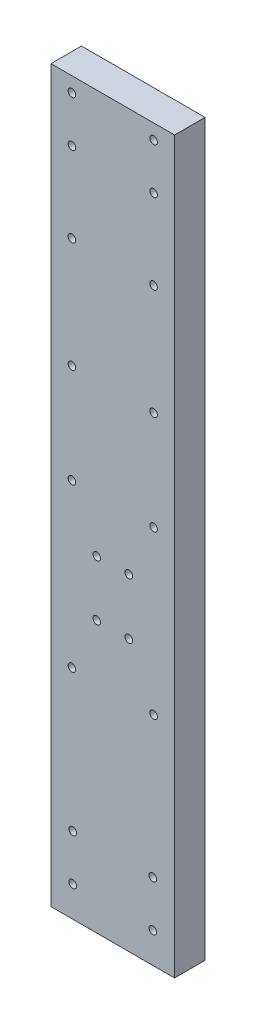
ISO-10303-21;
HEADER;
FILE_DESCRIPTION(('STEP AP214'),'2;1');
FILE_NAME('part.step','',(''),(''),'','','');
FILE_SCHEMA(('AUTOMOTIVE_DESIGN { 1 0 10303 214 1 1 1 1 }'));
ENDSEC;
DATA;
#1=APPLICATION_CONTEXT('core data for automotive mechanical design processes');
#2=APPLICATION_PROTOCOL_DEFINITION('international standard','automotive_design',2000,#1);
#3=PRODUCT_CONTEXT('',#1,'mechanical');
#4=PRODUCT('Part','Part','',(#3));
#5=PRODUCT_RELATED_PRODUCT_CATEGORY('part','',(#4));
#6=PRODUCT_DEFINITION_FORMATION('','',#4);
#7=PRODUCT_DEFINITION_CONTEXT('part definition',#1,'design');
#8=PRODUCT_DEFINITION('design','',#6,#7);
#9=PRODUCT_DEFINITION_SHAPE('','',#8);
#10=(LENGTH_UNIT() NAMED_UNIT(*) SI_UNIT(.MILLI.,.METRE.));
#11=(NAMED_UNIT(*) PLANE_ANGLE_UNIT() SI_UNIT($,.RADIAN.));
#12=(NAMED_UNIT(*) SI_UNIT($,.STERADIAN.) SOLID_ANGLE_UNIT());
#13=UNCERTAINTY_MEASURE_WITH_UNIT(LENGTH_MEASURE(1.E-05),#10,'distance_accuracy_value','');
#14=(GEOMETRIC_REPRESENTATION_CONTEXT(3) GLOBAL_UNCERTAINTY_ASSIGNED_CONTEXT((#13)) GLOBAL_UNIT_ASSIGNED_CONTEXT((#10,
#11,#12)) REPRESENTATION_CONTEXT('',''));
#15=CARTESIAN_POINT('',(0.,0.,0.));
#16=DIRECTION('',(0.,0.,1.));
#17=DIRECTION('',(1.,0.,0.));
#18=AXIS2_PLACEMENT_3D('',#15,#16,#17);
#19=CARTESIAN_POINT('',(0.,0.,4.));
#20=DIRECTION('',(0.,0.,-1.));
#21=DIRECTION('',(-1.,0.,0.));
#22=AXIS2_PLACEMENT_3D('',#19,#20,#21);
#23=PLANE('',#22);
#24=CARTESIAN_POINT('',(2.7500000000009,93.5614488310554,4.));
#25=DIRECTION('',(0.,0.,1.));
#26=DIRECTION('',(-1.,0.,0.));
#27=AXIS2_PLACEMENT_3D('',#24,#25,#26);
#28=CIRCLE('',#27,0.499999999999999);
#29=CARTESIAN_POINT('',(2.2500000000009,93.5614488310554,4.));
#30=VERTEX_POINT('',#29);
#31=EDGE_CURVE('E217',#30,#30,#28,.T.);
#32=ORIENTED_EDGE('',*,*,#31,.F.);
#33=EDGE_LOOP('',(#32));
#34=FACE_BOUND('',#33,.T.);
#35=CARTESIAN_POINT('',(13.4500000000022,87.5614488310554,4.));
#36=DIRECTION('',(0.,0.,1.));
#37=DIRECTION('',(1.,0.,0.));
#38=AXIS2_PLACEMENT_3D('',#35,#36,#37);
#39=CIRCLE('',#38,0.499999999999999);
#40=CARTESIAN_POINT('',(13.9500000000022,87.5614488310554,4.));
#41=VERTEX_POINT('',#40);
#42=EDGE_CURVE('E205',#41,#41,#39,.T.);
#43=ORIENTED_EDGE('',*,*,#42,.F.);
#44=EDGE_LOOP('',(#43));
#45=FACE_BOUND('',#44,.T.);
#46=CARTESIAN_POINT('',(13.4500000000001,77.0614488310554,4.));
#47=DIRECTION('',(0.,0.,1.));
#48=DIRECTION('',(1.,0.,0.));
#49=AXIS2_PLACEMENT_3D('',#46,#47,#48);
#50=CIRCLE('',#49,0.499999999999996);
#51=CARTESIAN_POINT('',(13.9500000000001,77.0614488310554,4.));
#52=VERTEX_POINT('',#51);
#53=EDGE_CURVE('E193',#52,#52,#50,.T.);
#54=ORIENTED_EDGE('',*,*,#53,.F.);
#55=EDGE_LOOP('',(#54));
#56=FACE_BOUND('',#55,.T.);
#57=CARTESIAN_POINT('',(13.350000000001,3.84644883105539,4.));
#58=DIRECTION('',(0.,0.,1.));
#59=DIRECTION('',(-1.,0.,0.));
#60=AXIS2_PLACEMENT_3D('',#57,#58,#59);
#61=CIRCLE('',#60,0.499999999999995);
#62=CARTESIAN_POINT('',(12.850000000001,3.84644883105539,4.));
#63=VERTEX_POINT('',#62);
#64=EDGE_CURVE('E181',#63,#63,#61,.T.);
#65=ORIENTED_EDGE('',*,*,#64,.F.);
#66=EDGE_LOOP('',(#65));
#67=FACE_BOUND('',#66,.T.);
#68=CARTESIAN_POINT('',(2.84999999999999,3.84644883105539,4.));
#69=DIRECTION('',(0.,0.,1.));
#70=DIRECTION('',(1.,0.,0.));
#71=AXIS2_PLACEMENT_3D('',#68,#69,#70);
#72=CIRCLE('',#71,0.499999999999999);
#73=CARTESIAN_POINT('',(3.34999999999999,3.84644883105539,4.));
#74=VERTEX_POINT('',#73);
#75=EDGE_CURVE('E169',#74,#74,#72,.T.);
#76=ORIENTED_EDGE('',*,*,#75,.F.);
#77=EDGE_LOOP('',(#76));
#78=FACE_BOUND('',#77,.T.);
#79=CARTESIAN_POINT('',(2.85,9.84644883105539,4.));
#80=DIRECTION('',(0.,0.,1.));
#81=DIRECTION('',(1.,0.,0.));
#82=AXIS2_PLACEMENT_3D('',#79,#80,#81);
#83=CIRCLE('',#82,0.499999999999999);
#84=CARTESIAN_POINT('',(3.35,9.84644883105539,4.));
#85=VERTEX_POINT('',#84);
#86=EDGE_CURVE('E157',#85,#85,#83,.T.);
#87=ORIENTED_EDGE('',*,*,#86,.F.);
#88=EDGE_LOOP('',(#87));
#89=FACE_BOUND('',#88,.T.);
#90=CARTESIAN_POINT('',(13.4500000000001,49.6064488310554,4.));
#91=DIRECTION('',(0.,0.,1.));
#92=DIRECTION('',(1.,0.,0.));
#93=AXIS2_PLACEMENT_3D('',#90,#91,#92);
#94=CIRCLE('',#93,0.499999999999999);
#95=CARTESIAN_POINT('',(13.9500000000001,49.6064488310554,4.));
#96=VERTEX_POINT('',#95);
#97=EDGE_CURVE('E145',#96,#96,#94,.T.);
#98=ORIENTED_EDGE('',*,*,#97,.F.);
#99=EDGE_LOOP('',(#98));
#100=FACE_BOUND('',#99,.T.);
#101=CARTESIAN_POINT('',(13.4500000000001,28.3464488310553,4.));
#102=DIRECTION('',(0.,0.,1.));
#103=DIRECTION('',(1.,0.,0.));
#104=AXIS2_PLACEMENT_3D('',#101,#102,#103);
#105=CIRCLE('',#104,0.499999999999999);
#106=CARTESIAN_POINT('',(13.9500000000001,28.3464488310553,4.));
#107=VERTEX_POINT('',#106);
#108=EDGE_CURVE('E133',#107,#107,#105,.T.);
#109=ORIENTED_EDGE('',*,*,#108,.F.);
#110=EDGE_LOOP('',(#109));
#111=FACE_BOUND('',#110,.T.);
#112=CARTESIAN_POINT('',(10.2000000000001,35.346448831055,4.));
#113=DIRECTION('',(0.,0.,1.));
#114=DIRECTION('',(1.,0.,0.));
#115=AXIS2_PLACEMENT_3D('',#112,#113,#114);
#116=CIRCLE('',#115,0.499999999999999);
#117=CARTESIAN_POINT('',(10.7000000000001,35.346448831055,4.));
#118=VERTEX_POINT('',#117);
#119=EDGE_CURVE('E121',#118,#118,#116,.T.);
#120=ORIENTED_EDGE('',*,*,#119,.F.);
#121=EDGE_LOOP('',(#120));
#122=FACE_BOUND('',#121,.T.);
#123=CARTESIAN_POINT('',(10.2000000000001,42.6664488310547,4.));
#124=DIRECTION('',(0.,0.,1.));
#125=DIRECTION('',(1.,0.,0.));
#126=AXIS2_PLACEMENT_3D('',#123,#124,#125);
#127=CIRCLE('',#126,0.499999999999999);
#128=CARTESIAN_POINT('',(10.7000000000001,42.6664488310547,4.));
#129=VERTEX_POINT('',#128);
#130=EDGE_CURVE('E100',#129,#129,#127,.T.);
#131=ORIENTED_EDGE('',*,*,#130,.F.);
#132=EDGE_LOOP('',(#131));
#133=FACE_BOUND('',#132,.T.);
#134=DIRECTION('',(1.,0.,0.));
#135=VECTOR('',#134,1.);
#136=CARTESIAN_POINT('',(0.,-0.15355116894461,4.));
#137=LINE('',#136,#135);
#138=CARTESIAN_POINT('',(0.,-0.15355116894461,4.));
#139=VERTEX_POINT('',#138);
#140=CARTESIAN_POINT('',(16.2,-0.15355116894461,4.));
#141=VERTEX_POINT('',#140);
#142=EDGE_CURVE('E85',#139,#141,#137,.T.);
#143=ORIENTED_EDGE('',*,*,#142,.T.);
#144=DIRECTION('',(0.,1.,0.));
#145=VECTOR('',#144,1.);
#146=CARTESIAN_POINT('',(16.2,95.5064488310554,4.));
#147=LINE('',#146,#145);
#148=CARTESIAN_POINT('',(16.2,95.5064488310554,4.));
#149=VERTEX_POINT('',#148);
#150=EDGE_CURVE('E80',#141,#149,#147,.T.);
#151=ORIENTED_EDGE('',*,*,#150,.T.);
#152=DIRECTION('',(-1.,0.,0.));
#153=VECTOR('',#152,1.);
#154=CARTESIAN_POINT('',(0.,95.5064488310554,4.));
#155=LINE('',#154,#153);
#156=CARTESIAN_POINT('',(0.,95.5064488310554,4.));
#157=VERTEX_POINT('',#156);
#158=EDGE_CURVE('E83',#149,#157,#155,.T.);
#159=ORIENTED_EDGE('',*,*,#158,.T.);
#160=DIRECTION('',(0.,-1.,0.));
#161=VECTOR('',#160,1.);
#162=CARTESIAN_POINT('',(0.,95.5064488310554,4.));
#163=LINE('',#162,#161);
#164=EDGE_CURVE('E50',#157,#139,#163,.T.);
#165=ORIENTED_EDGE('',*,*,#164,.T.);
#166=EDGE_LOOP('',(#143,#151,#159,#165));
#167=FACE_BOUND('',#166,.T.);
#168=CARTESIAN_POINT('',(6.,42.6064488310554,4.));
#169=DIRECTION('',(0.,0.,1.));
#170=DIRECTION('',(1.,0.,0.));
#171=AXIS2_PLACEMENT_3D('',#168,#169,#170);
#172=CIRCLE('',#171,0.500000000000001);
#173=CARTESIAN_POINT('',(6.5,42.6064488310554,4.));
#174=VERTEX_POINT('',#173);
#175=EDGE_CURVE('E115',#174,#174,#172,.T.);
#176=ORIENTED_EDGE('',*,*,#175,.F.);
#177=EDGE_LOOP('',(#176));
#178=FACE_BOUND('',#177,.T.);
#179=CARTESIAN_POINT('',(6.,35.346448831055,4.));
#180=DIRECTION('',(0.,0.,1.));
#181=DIRECTION('',(1.,0.,0.));
#182=AXIS2_PLACEMENT_3D('',#179,#180,#181);
#183=CIRCLE('',#182,0.499999999999999);
#184=CARTESIAN_POINT('',(6.5,35.346448831055,4.));
#185=VERTEX_POINT('',#184);
#186=EDGE_CURVE('E127',#185,#185,#183,.T.);
#187=ORIENTED_EDGE('',*,*,#186,.F.);
#188=EDGE_LOOP('',(#187));
#189=FACE_BOUND('',#188,.T.);
#190=CARTESIAN_POINT('',(2.75000000000003,28.3464488310555,4.));
#191=DIRECTION('',(0.,0.,1.));
#192=DIRECTION('',(1.,0.,0.));
#193=AXIS2_PLACEMENT_3D('',#190,#191,#192);
#194=CIRCLE('',#193,0.499999999999999);
#195=CARTESIAN_POINT('',(3.25000000000003,28.3464488310555,4.));
#196=VERTEX_POINT('',#195);
#197=EDGE_CURVE('E139',#196,#196,#194,.T.);
#198=ORIENTED_EDGE('',*,*,#197,.F.);
#199=EDGE_LOOP('',(#198));
#200=FACE_BOUND('',#199,.T.);
#201=CARTESIAN_POINT('',(2.75000000000002,49.6064488310554,4.));
#202=DIRECTION('',(0.,0.,1.));
#203=DIRECTION('',(1.,0.,0.));
#204=AXIS2_PLACEMENT_3D('',#201,#202,#203);
#205=CIRCLE('',#204,0.499999999999999);
#206=CARTESIAN_POINT('',(3.25000000000002,49.6064488310554,4.));
#207=VERTEX_POINT('',#206);
#208=EDGE_CURVE('E151',#207,#207,#205,.T.);
#209=ORIENTED_EDGE('',*,*,#208,.F.);
#210=EDGE_LOOP('',(#209));
#211=FACE_BOUND('',#210,.T.);
#212=CARTESIAN_POINT('',(13.4500000000016,62.6064488310554,4.));
#213=DIRECTION('',(0.,0.,1.));
#214=DIRECTION('',(1.,0.,0.));
#215=AXIS2_PLACEMENT_3D('',#212,#213,#214);
#216=CIRCLE('',#215,0.499999999999996);
#217=CARTESIAN_POINT('',(13.9500000000016,62.6064488310554,4.));
#218=VERTEX_POINT('',#217);
#219=EDGE_CURVE('E163',#218,#218,#216,.T.);
#220=ORIENTED_EDGE('',*,*,#219,.F.);
#221=EDGE_LOOP('',(#220));
#222=FACE_BOUND('',#221,.T.);
#223=CARTESIAN_POINT('',(13.350000000001,9.8464488310554,4.));
#224=DIRECTION('',(0.,0.,1.));
#225=DIRECTION('',(-1.,0.,0.));
#226=AXIS2_PLACEMENT_3D('',#223,#224,#225);
#227=CIRCLE('',#226,0.499999999999999);
#228=CARTESIAN_POINT('',(12.850000000001,9.8464488310554,4.));
#229=VERTEX_POINT('',#228);
#230=EDGE_CURVE('E175',#229,#229,#227,.T.);
#231=ORIENTED_EDGE('',*,*,#230,.F.);
#232=EDGE_LOOP('',(#231));
#233=FACE_BOUND('',#232,.T.);
#234=CARTESIAN_POINT('',(2.75000000000136,62.6064488310554,4.));
#235=DIRECTION('',(0.,0.,1.));
#236=DIRECTION('',(1.,0.,0.));
#237=AXIS2_PLACEMENT_3D('',#234,#235,#236);
#238=CIRCLE('',#237,0.499999999999999);
#239=CARTESIAN_POINT('',(3.25000000000136,62.6064488310554,4.));
#240=VERTEX_POINT('',#239);
#241=EDGE_CURVE('E187',#240,#240,#238,.T.);
#242=ORIENTED_EDGE('',*,*,#241,.F.);
#243=EDGE_LOOP('',(#242));
#244=FACE_BOUND('',#243,.T.);
#245=CARTESIAN_POINT('',(2.75000000000002,77.0614488310554,4.));
#246=DIRECTION('',(0.,0.,1.));
#247=DIRECTION('',(1.,0.,0.));
#248=AXIS2_PLACEMENT_3D('',#245,#246,#247);
#249=CIRCLE('',#248,0.499999999999999);
#250=CARTESIAN_POINT('',(3.25000000000002,77.0614488310554,4.));
#251=VERTEX_POINT('',#250);
#252=EDGE_CURVE('E199',#251,#251,#249,.T.);
#253=ORIENTED_EDGE('',*,*,#252,.F.);
#254=EDGE_LOOP('',(#253));
#255=FACE_BOUND('',#254,.T.);
#256=CARTESIAN_POINT('',(2.7500000000009,87.5614488310554,4.));
#257=DIRECTION('',(0.,0.,1.));
#258=DIRECTION('',(1.,0.,0.));
#259=AXIS2_PLACEMENT_3D('',#256,#257,#258);
#260=CIRCLE('',#259,0.499999999999999);
#261=CARTESIAN_POINT('',(3.2500000000009,87.5614488310554,4.));
#262=VERTEX_POINT('',#261);
#263=EDGE_CURVE('E211',#262,#262,#260,.T.);
#264=ORIENTED_EDGE('',*,*,#263,.F.);
#265=EDGE_LOOP('',(#264));
#266=FACE_BOUND('',#265,.T.);
#267=CARTESIAN_POINT('',(13.4500000000022,93.5614488310554,4.));
#268=DIRECTION('',(0.,0.,1.));
#269=DIRECTION('',(-1.,0.,0.));
#270=AXIS2_PLACEMENT_3D('',#267,#268,#269);
#271=CIRCLE('',#270,0.499999999999996);
#272=CARTESIAN_POINT('',(12.9500000000022,93.5614488310554,4.));
#273=VERTEX_POINT('',#272);
#274=EDGE_CURVE('E223',#273,#273,#271,.T.);
#275=ORIENTED_EDGE('',*,*,#274,.F.);
#276=EDGE_LOOP('',(#275));
#277=FACE_BOUND('',#276,.T.);
#278=ADVANCED_FACE('F33',(#34,#45,#56,#67,#78,#89,#100,#111,#122,#133,#167,#178,#189,#200,#211,
#222,#233,#244,#255,#266,#277),#23,.F.);
#279=CARTESIAN_POINT('',(0.,0.,0.));
#280=DIRECTION('',(0.,0.,-1.));
#281=DIRECTION('',(-1.,0.,0.));
#282=AXIS2_PLACEMENT_3D('',#279,#280,#281);
#283=PLANE('',#282);
#284=CARTESIAN_POINT('',(2.7500000000009,93.5614488310554,0.));
#285=DIRECTION('',(0.,0.,1.));
#286=DIRECTION('',(-1.,0.,0.));
#287=AXIS2_PLACEMENT_3D('',#284,#285,#286);
#288=CIRCLE('',#287,0.499999999999999);
#289=CARTESIAN_POINT('',(2.2500000000009,93.5614488310554,0.));
#290=VERTEX_POINT('',#289);
#291=EDGE_CURVE('E220',#290,#290,#288,.T.);
#292=ORIENTED_EDGE('',*,*,#291,.T.);
#293=EDGE_LOOP('',(#292));
#294=FACE_BOUND('',#293,.T.);
#295=CARTESIAN_POINT('',(13.4500000000022,87.5614488310554,0.));
#296=DIRECTION('',(0.,0.,1.));
#297=DIRECTION('',(1.,0.,0.));
#298=AXIS2_PLACEMENT_3D('',#295,#296,#297);
#299=CIRCLE('',#298,0.499999999999999);
#300=CARTESIAN_POINT('',(13.9500000000022,87.5614488310554,0.));
#301=VERTEX_POINT('',#300);
#302=EDGE_CURVE('E208',#301,#301,#299,.T.);
#303=ORIENTED_EDGE('',*,*,#302,.T.);
#304=EDGE_LOOP('',(#303));
#305=FACE_BOUND('',#304,.T.);
#306=CARTESIAN_POINT('',(13.4500000000001,77.0614488310554,0.));
#307=DIRECTION('',(0.,0.,1.));
#308=DIRECTION('',(1.,0.,0.));
#309=AXIS2_PLACEMENT_3D('',#306,#307,#308);
#310=CIRCLE('',#309,0.499999999999996);
#311=CARTESIAN_POINT('',(13.9500000000001,77.0614488310554,0.));
#312=VERTEX_POINT('',#311);
#313=EDGE_CURVE('E196',#312,#312,#310,.T.);
#314=ORIENTED_EDGE('',*,*,#313,.T.);
#315=EDGE_LOOP('',(#314));
#316=FACE_BOUND('',#315,.T.);
#317=CARTESIAN_POINT('',(13.350000000001,3.84644883105539,0.));
#318=DIRECTION('',(0.,0.,1.));
#319=DIRECTION('',(-1.,0.,0.));
#320=AXIS2_PLACEMENT_3D('',#317,#318,#319);
#321=CIRCLE('',#320,0.499999999999995);
#322=CARTESIAN_POINT('',(12.850000000001,3.84644883105539,0.));
#323=VERTEX_POINT('',#322);
#324=EDGE_CURVE('E184',#323,#323,#321,.T.);
#325=ORIENTED_EDGE('',*,*,#324,.T.);
#326=EDGE_LOOP('',(#325));
#327=FACE_BOUND('',#326,.T.);
#328=CARTESIAN_POINT('',(2.84999999999999,3.84644883105539,0.));
#329=DIRECTION('',(0.,0.,1.));
#330=DIRECTION('',(1.,0.,0.));
#331=AXIS2_PLACEMENT_3D('',#328,#329,#330);
#332=CIRCLE('',#331,0.499999999999999);
#333=CARTESIAN_POINT('',(3.34999999999999,3.84644883105539,0.));
#334=VERTEX_POINT('',#333);
#335=EDGE_CURVE('E172',#334,#334,#332,.T.);
#336=ORIENTED_EDGE('',*,*,#335,.T.);
#337=EDGE_LOOP('',(#336));
#338=FACE_BOUND('',#337,.T.);
#339=CARTESIAN_POINT('',(2.85,9.84644883105539,0.));
#340=DIRECTION('',(0.,0.,1.));
#341=DIRECTION('',(1.,0.,0.));
#342=AXIS2_PLACEMENT_3D('',#339,#340,#341);
#343=CIRCLE('',#342,0.499999999999999);
#344=CARTESIAN_POINT('',(3.35,9.84644883105539,0.));
#345=VERTEX_POINT('',#344);
#346=EDGE_CURVE('E160',#345,#345,#343,.T.);
#347=ORIENTED_EDGE('',*,*,#346,.T.);
#348=EDGE_LOOP('',(#347));
#349=FACE_BOUND('',#348,.T.);
#350=CARTESIAN_POINT('',(13.4500000000001,49.6064488310554,0.));
#351=DIRECTION('',(0.,0.,1.));
#352=DIRECTION('',(1.,0.,0.));
#353=AXIS2_PLACEMENT_3D('',#350,#351,#352);
#354=CIRCLE('',#353,0.499999999999999);
#355=CARTESIAN_POINT('',(13.9500000000001,49.6064488310554,0.));
#356=VERTEX_POINT('',#355);
#357=EDGE_CURVE('E148',#356,#356,#354,.T.);
#358=ORIENTED_EDGE('',*,*,#357,.T.);
#359=EDGE_LOOP('',(#358));
#360=FACE_BOUND('',#359,.T.);
#361=CARTESIAN_POINT('',(13.4500000000001,28.3464488310553,0.));
#362=DIRECTION('',(0.,0.,1.));
#363=DIRECTION('',(1.,0.,0.));
#364=AXIS2_PLACEMENT_3D('',#361,#362,#363);
#365=CIRCLE('',#364,0.499999999999999);
#366=CARTESIAN_POINT('',(13.9500000000001,28.3464488310553,0.));
#367=VERTEX_POINT('',#366);
#368=EDGE_CURVE('E136',#367,#367,#365,.T.);
#369=ORIENTED_EDGE('',*,*,#368,.T.);
#370=EDGE_LOOP('',(#369));
#371=FACE_BOUND('',#370,.T.);
#372=CARTESIAN_POINT('',(10.2000000000001,35.346448831055,0.));
#373=DIRECTION('',(0.,0.,1.));
#374=DIRECTION('',(1.,0.,0.));
#375=AXIS2_PLACEMENT_3D('',#372,#373,#374);
#376=CIRCLE('',#375,0.499999999999999);
#377=CARTESIAN_POINT('',(10.7000000000001,35.346448831055,0.));
#378=VERTEX_POINT('',#377);
#379=EDGE_CURVE('E124',#378,#378,#376,.T.);
#380=ORIENTED_EDGE('',*,*,#379,.T.);
#381=EDGE_LOOP('',(#380));
#382=FACE_BOUND('',#381,.T.);
#383=CARTESIAN_POINT('',(10.2000000000001,42.6664488310547,0.));
#384=DIRECTION('',(0.,0.,1.));
#385=DIRECTION('',(1.,0.,0.));
#386=AXIS2_PLACEMENT_3D('',#383,#384,#385);
#387=CIRCLE('',#386,0.499999999999999);
#388=CARTESIAN_POINT('',(10.7000000000001,42.6664488310547,0.));
#389=VERTEX_POINT('',#388);
#390=EDGE_CURVE('E112',#389,#389,#387,.T.);
#391=ORIENTED_EDGE('',*,*,#390,.T.);
#392=EDGE_LOOP('',(#391));
#393=FACE_BOUND('',#392,.T.);
#394=DIRECTION('',(1.,0.,0.));
#395=VECTOR('',#394,1.);
#396=CARTESIAN_POINT('',(0.,-0.15355116894461,0.));
#397=LINE('',#396,#395);
#398=CARTESIAN_POINT('',(0.,-0.15355116894461,0.));
#399=VERTEX_POINT('',#398);
#400=CARTESIAN_POINT('',(16.2,-0.15355116894461,0.));
#401=VERTEX_POINT('',#400);
#402=EDGE_CURVE('E97',#399,#401,#397,.T.);
#403=ORIENTED_EDGE('',*,*,#402,.F.);
#404=DIRECTION('',(0.,-1.,0.));
#405=VECTOR('',#404,1.);
#406=CARTESIAN_POINT('',(0.,95.5064488310554,0.));
#407=LINE('',#406,#405);
#408=CARTESIAN_POINT('',(0.,95.5064488310554,0.));
#409=VERTEX_POINT('',#408);
#410=EDGE_CURVE('E73',#409,#399,#407,.T.);
#411=ORIENTED_EDGE('',*,*,#410,.F.);
#412=DIRECTION('',(-1.,0.,0.));
#413=VECTOR('',#412,1.);
#414=CARTESIAN_POINT('',(0.,95.5064488310554,0.));
#415=LINE('',#414,#413);
#416=CARTESIAN_POINT('',(16.2,95.5064488310554,0.));
#417=VERTEX_POINT('',#416);
#418=EDGE_CURVE('E67',#417,#409,#415,.T.);
#419=ORIENTED_EDGE('',*,*,#418,.F.);
#420=DIRECTION('',(0.,1.,0.));
#421=VECTOR('',#420,1.);
#422=CARTESIAN_POINT('',(16.2,95.5064488310554,0.));
#423=LINE('',#422,#421);
#424=EDGE_CURVE('E89',#401,#417,#423,.T.);
#425=ORIENTED_EDGE('',*,*,#424,.F.);
#426=EDGE_LOOP('',(#403,#411,#419,#425));
#427=FACE_BOUND('',#426,.T.);
#428=CARTESIAN_POINT('',(6.,42.6064488310554,0.));
#429=DIRECTION('',(0.,0.,1.));
#430=DIRECTION('',(1.,0.,0.));
#431=AXIS2_PLACEMENT_3D('',#428,#429,#430);
#432=CIRCLE('',#431,0.500000000000001);
#433=CARTESIAN_POINT('',(6.5,42.6064488310554,0.));
#434=VERTEX_POINT('',#433);
#435=EDGE_CURVE('E118',#434,#434,#432,.T.);
#436=ORIENTED_EDGE('',*,*,#435,.T.);
#437=EDGE_LOOP('',(#436));
#438=FACE_BOUND('',#437,.T.);
#439=CARTESIAN_POINT('',(6.,35.346448831055,0.));
#440=DIRECTION('',(0.,0.,1.));
#441=DIRECTION('',(1.,0.,0.));
#442=AXIS2_PLACEMENT_3D('',#439,#440,#441);
#443=CIRCLE('',#442,0.499999999999999);
#444=CARTESIAN_POINT('',(6.5,35.346448831055,0.));
#445=VERTEX_POINT('',#444);
#446=EDGE_CURVE('E130',#445,#445,#443,.T.);
#447=ORIENTED_EDGE('',*,*,#446,.T.);
#448=EDGE_LOOP('',(#447));
#449=FACE_BOUND('',#448,.T.);
#450=CARTESIAN_POINT('',(2.75000000000003,28.3464488310555,0.));
#451=DIRECTION('',(0.,0.,1.));
#452=DIRECTION('',(1.,0.,0.));
#453=AXIS2_PLACEMENT_3D('',#450,#451,#452);
#454=CIRCLE('',#453,0.499999999999999);
#455=CARTESIAN_POINT('',(3.25000000000003,28.3464488310555,0.));
#456=VERTEX_POINT('',#455);
#457=EDGE_CURVE('E142',#456,#456,#454,.T.);
#458=ORIENTED_EDGE('',*,*,#457,.T.);
#459=EDGE_LOOP('',(#458));
#460=FACE_BOUND('',#459,.T.);
#461=CARTESIAN_POINT('',(2.75000000000002,49.6064488310554,0.));
#462=DIRECTION('',(0.,0.,1.));
#463=DIRECTION('',(1.,0.,0.));
#464=AXIS2_PLACEMENT_3D('',#461,#462,#463);
#465=CIRCLE('',#464,0.499999999999999);
#466=CARTESIAN_POINT('',(3.25000000000002,49.6064488310554,0.));
#467=VERTEX_POINT('',#466);
#468=EDGE_CURVE('E154',#467,#467,#465,.T.);
#469=ORIENTED_EDGE('',*,*,#468,.T.);
#470=EDGE_LOOP('',(#469));
#471=FACE_BOUND('',#470,.T.);
#472=CARTESIAN_POINT('',(13.4500000000016,62.6064488310554,0.));
#473=DIRECTION('',(0.,0.,1.));
#474=DIRECTION('',(1.,0.,0.));
#475=AXIS2_PLACEMENT_3D('',#472,#473,#474);
#476=CIRCLE('',#475,0.499999999999996);
#477=CARTESIAN_POINT('',(13.9500000000016,62.6064488310554,0.));
#478=VERTEX_POINT('',#477);
#479=EDGE_CURVE('E166',#478,#478,#476,.T.);
#480=ORIENTED_EDGE('',*,*,#479,.T.);
#481=EDGE_LOOP('',(#480));
#482=FACE_BOUND('',#481,.T.);
#483=CARTESIAN_POINT('',(13.350000000001,9.8464488310554,0.));
#484=DIRECTION('',(0.,0.,1.));
#485=DIRECTION('',(-1.,0.,0.));
#486=AXIS2_PLACEMENT_3D('',#483,#484,#485);
#487=CIRCLE('',#486,0.499999999999999);
#488=CARTESIAN_POINT('',(12.850000000001,9.8464488310554,0.));
#489=VERTEX_POINT('',#488);
#490=EDGE_CURVE('E178',#489,#489,#487,.T.);
#491=ORIENTED_EDGE('',*,*,#490,.T.);
#492=EDGE_LOOP('',(#491));
#493=FACE_BOUND('',#492,.T.);
#494=CARTESIAN_POINT('',(2.75000000000136,62.6064488310554,0.));
#495=DIRECTION('',(0.,0.,1.));
#496=DIRECTION('',(1.,0.,0.));
#497=AXIS2_PLACEMENT_3D('',#494,#495,#496);
#498=CIRCLE('',#497,0.499999999999999);
#499=CARTESIAN_POINT('',(3.25000000000136,62.6064488310554,0.));
#500=VERTEX_POINT('',#499);
#501=EDGE_CURVE('E190',#500,#500,#498,.T.);
#502=ORIENTED_EDGE('',*,*,#501,.T.);
#503=EDGE_LOOP('',(#502));
#504=FACE_BOUND('',#503,.T.);
#505=CARTESIAN_POINT('',(2.75000000000002,77.0614488310554,0.));
#506=DIRECTION('',(0.,0.,1.));
#507=DIRECTION('',(1.,0.,0.));
#508=AXIS2_PLACEMENT_3D('',#505,#506,#507);
#509=CIRCLE('',#508,0.499999999999999);
#510=CARTESIAN_POINT('',(3.25000000000002,77.0614488310554,0.));
#511=VERTEX_POINT('',#510);
#512=EDGE_CURVE('E202',#511,#511,#509,.T.);
#513=ORIENTED_EDGE('',*,*,#512,.T.);
#514=EDGE_LOOP('',(#513));
#515=FACE_BOUND('',#514,.T.);
#516=CARTESIAN_POINT('',(2.7500000000009,87.5614488310554,0.));
#517=DIRECTION('',(0.,0.,1.));
#518=DIRECTION('',(1.,0.,0.));
#519=AXIS2_PLACEMENT_3D('',#516,#517,#518);
#520=CIRCLE('',#519,0.499999999999999);
#521=CARTESIAN_POINT('',(3.2500000000009,87.5614488310554,0.));
#522=VERTEX_POINT('',#521);
#523=EDGE_CURVE('E214',#522,#522,#520,.T.);
#524=ORIENTED_EDGE('',*,*,#523,.T.);
#525=EDGE_LOOP('',(#524));
#526=FACE_BOUND('',#525,.T.);
#527=CARTESIAN_POINT('',(13.4500000000022,93.5614488310554,0.));
#528=DIRECTION('',(0.,0.,1.));
#529=DIRECTION('',(-1.,0.,0.));
#530=AXIS2_PLACEMENT_3D('',#527,#528,#529);
#531=CIRCLE('',#530,0.499999999999996);
#532=CARTESIAN_POINT('',(12.9500000000022,93.5614488310554,0.));
#533=VERTEX_POINT('',#532);
#534=EDGE_CURVE('E226',#533,#533,#531,.T.);
#535=ORIENTED_EDGE('',*,*,#534,.T.);
#536=EDGE_LOOP('',(#535));
#537=FACE_BOUND('',#536,.T.);
#538=ADVANCED_FACE('F108',(#294,#305,#316,#327,#338,#349,#360,#371,#382,#393,#427,#438,#449,
#460,#471,#482,#493,#504,#515,#526,#537),#283,.T.);
#539=CARTESIAN_POINT('',(0.,-0.15355116894461,4.));
#540=DIRECTION('',(0.,1.,0.));
#541=DIRECTION('',(0.,0.,1.));
#542=AXIS2_PLACEMENT_3D('',#539,#540,#541);
#543=PLANE('',#542);
#544=ORIENTED_EDGE('',*,*,#402,.T.);
#545=DIRECTION('',(0.,0.,-1.));
#546=VECTOR('',#545,1.);
#547=CARTESIAN_POINT('',(16.2,-0.15355116894461,4.));
#548=LINE('',#547,#546);
#549=EDGE_CURVE('E11',#141,#401,#548,.T.);
#550=ORIENTED_EDGE('',*,*,#549,.F.);
#551=ORIENTED_EDGE('',*,*,#142,.F.);
#552=DIRECTION('',(0.,0.,-1.));
#553=VECTOR('',#552,1.);
#554=CARTESIAN_POINT('',(0.,-0.15355116894461,4.));
#555=LINE('',#554,#553);
#556=EDGE_CURVE('E93',#139,#399,#555,.T.);
#557=ORIENTED_EDGE('',*,*,#556,.T.);
#558=EDGE_LOOP('',(#544,#550,#551,#557));
#559=FACE_BOUND('',#558,.T.);
#560=ADVANCED_FACE('F35',(#559),#543,.F.);
#561=CARTESIAN_POINT('',(16.2,95.5064488310554,4.));
#562=DIRECTION('',(-1.,0.,0.));
#563=DIRECTION('',(0.,-1.,0.));
#564=AXIS2_PLACEMENT_3D('',#561,#562,#563);
#565=PLANE('',#564);
#566=ORIENTED_EDGE('',*,*,#424,.T.);
#567=DIRECTION('',(0.,0.,-1.));
#568=VECTOR('',#567,1.);
#569=CARTESIAN_POINT('',(16.2,95.5064488310554,4.));
#570=LINE('',#569,#568);
#571=EDGE_CURVE('E42',#149,#417,#570,.T.);
#572=ORIENTED_EDGE('',*,*,#571,.F.);
#573=ORIENTED_EDGE('',*,*,#150,.F.);
#574=ORIENTED_EDGE('',*,*,#549,.T.);
#575=EDGE_LOOP('',(#566,#572,#573,#574));
#576=FACE_BOUND('',#575,.T.);
#577=ADVANCED_FACE('F88',(#576),#565,.F.);
#578=CARTESIAN_POINT('',(0.,95.5064488310554,4.));
#579=DIRECTION('',(0.,-1.,0.));
#580=DIRECTION('',(0.,0.,-1.));
#581=AXIS2_PLACEMENT_3D('',#578,#579,#580);
#582=PLANE('',#581);
#583=ORIENTED_EDGE('',*,*,#418,.T.);
#584=DIRECTION('',(0.,0.,-1.));
#585=VECTOR('',#584,1.);
#586=CARTESIAN_POINT('',(0.,95.5064488310554,4.));
#587=LINE('',#586,#585);
#588=EDGE_CURVE('E90',#157,#409,#587,.T.);
#589=ORIENTED_EDGE('',*,*,#588,.F.);
#590=ORIENTED_EDGE('',*,*,#158,.F.);
#591=ORIENTED_EDGE('',*,*,#571,.T.);
#592=EDGE_LOOP('',(#583,#589,#590,#591));
#593=FACE_BOUND('',#592,.T.);
#594=ADVANCED_FACE('F91',(#593),#582,.F.);
#595=CARTESIAN_POINT('',(0.,95.5064488310554,4.));
#596=DIRECTION('',(1.,0.,0.));
#597=DIRECTION('',(0.,1.,0.));
#598=AXIS2_PLACEMENT_3D('',#595,#596,#597);
#599=PLANE('',#598);
#600=ORIENTED_EDGE('',*,*,#410,.T.);
#601=ORIENTED_EDGE('',*,*,#556,.F.);
#602=ORIENTED_EDGE('',*,*,#164,.F.);
#603=ORIENTED_EDGE('',*,*,#588,.T.);
#604=EDGE_LOOP('',(#600,#601,#602,#603));
#605=FACE_BOUND('',#604,.T.);
#606=ADVANCED_FACE('F105',(#605),#599,.F.);
#607=CARTESIAN_POINT('',(10.2000000000001,42.6664488310547,4.));
#608=DIRECTION('',(0.,0.,-1.));
#609=DIRECTION('',(-1.,0.,0.));
#610=AXIS2_PLACEMENT_3D('',#607,#608,#609);
#611=CYLINDRICAL_SURFACE('',#610,0.499999999999999);
#612=ORIENTED_EDGE('',*,*,#130,.T.);
#613=EDGE_LOOP('',(#612));
#614=FACE_BOUND('',#613,.T.);
#615=ORIENTED_EDGE('',*,*,#390,.F.);
#616=EDGE_LOOP('',(#615));
#617=FACE_BOUND('',#616,.T.);
#618=ADVANCED_FACE('F246',(#614,#617),#611,.F.);
#619=CARTESIAN_POINT('',(6.,42.6064488310554,4.));
#620=DIRECTION('',(0.,0.,-1.));
#621=DIRECTION('',(-1.,0.,0.));
#622=AXIS2_PLACEMENT_3D('',#619,#620,#621);
#623=CYLINDRICAL_SURFACE('',#622,0.500000000000001);
#624=ORIENTED_EDGE('',*,*,#175,.T.);
#625=EDGE_LOOP('',(#624));
#626=FACE_BOUND('',#625,.T.);
#627=ORIENTED_EDGE('',*,*,#435,.F.);
#628=EDGE_LOOP('',(#627));
#629=FACE_BOUND('',#628,.T.);
#630=ADVANCED_FACE('F292',(#626,#629),#623,.F.);
#631=CARTESIAN_POINT('',(10.2000000000001,35.346448831055,4.));
#632=DIRECTION('',(0.,0.,-1.));
#633=DIRECTION('',(-1.,0.,0.));
#634=AXIS2_PLACEMENT_3D('',#631,#632,#633);
#635=CYLINDRICAL_SURFACE('',#634,0.499999999999999);
#636=ORIENTED_EDGE('',*,*,#119,.T.);
#637=EDGE_LOOP('',(#636));
#638=FACE_BOUND('',#637,.T.);
#639=ORIENTED_EDGE('',*,*,#379,.F.);
#640=EDGE_LOOP('',(#639));
#641=FACE_BOUND('',#640,.T.);
#642=ADVANCED_FACE('F300',(#638,#641),#635,.F.);
#643=CARTESIAN_POINT('',(6.,35.346448831055,4.));
#644=DIRECTION('',(0.,0.,-1.));
#645=DIRECTION('',(-1.,0.,0.));
#646=AXIS2_PLACEMENT_3D('',#643,#644,#645);
#647=CYLINDRICAL_SURFACE('',#646,0.499999999999999);
#648=ORIENTED_EDGE('',*,*,#186,.T.);
#649=EDGE_LOOP('',(#648));
#650=FACE_BOUND('',#649,.T.);
#651=ORIENTED_EDGE('',*,*,#446,.F.);
#652=EDGE_LOOP('',(#651));
#653=FACE_BOUND('',#652,.T.);
#654=ADVANCED_FACE('F308',(#650,#653),#647,.F.);
#655=CARTESIAN_POINT('',(13.4500000000001,28.3464488310553,4.));
#656=DIRECTION('',(0.,0.,-1.));
#657=DIRECTION('',(-1.,0.,0.));
#658=AXIS2_PLACEMENT_3D('',#655,#656,#657);
#659=CYLINDRICAL_SURFACE('',#658,0.499999999999999);
#660=ORIENTED_EDGE('',*,*,#108,.T.);
#661=EDGE_LOOP('',(#660));
#662=FACE_BOUND('',#661,.T.);
#663=ORIENTED_EDGE('',*,*,#368,.F.);
#664=EDGE_LOOP('',(#663));
#665=FACE_BOUND('',#664,.T.);
#666=ADVANCED_FACE('F317',(#662,#665),#659,.F.);
#667=CARTESIAN_POINT('',(2.75000000000003,28.3464488310555,4.));
#668=DIRECTION('',(0.,0.,-1.));
#669=DIRECTION('',(-1.,0.,0.));
#670=AXIS2_PLACEMENT_3D('',#667,#668,#669);
#671=CYLINDRICAL_SURFACE('',#670,0.499999999999999);
#672=ORIENTED_EDGE('',*,*,#197,.T.);
#673=EDGE_LOOP('',(#672));
#674=FACE_BOUND('',#673,.T.);
#675=ORIENTED_EDGE('',*,*,#457,.F.);
#676=EDGE_LOOP('',(#675));
#677=FACE_BOUND('',#676,.T.);
#678=ADVANCED_FACE('F326',(#674,#677),#671,.F.);
#679=CARTESIAN_POINT('',(13.4500000000001,49.6064488310554,4.));
#680=DIRECTION('',(0.,0.,-1.));
#681=DIRECTION('',(-1.,0.,0.));
#682=AXIS2_PLACEMENT_3D('',#679,#680,#681);
#683=CYLINDRICAL_SURFACE('',#682,0.499999999999999);
#684=ORIENTED_EDGE('',*,*,#97,.T.);
#685=EDGE_LOOP('',(#684));
#686=FACE_BOUND('',#685,.T.);
#687=ORIENTED_EDGE('',*,*,#357,.F.);
#688=EDGE_LOOP('',(#687));
#689=FACE_BOUND('',#688,.T.);
#690=ADVANCED_FACE('F335',(#686,#689),#683,.F.);
#691=CARTESIAN_POINT('',(2.75000000000002,49.6064488310554,4.));
#692=DIRECTION('',(0.,0.,-1.));
#693=DIRECTION('',(-1.,0.,0.));
#694=AXIS2_PLACEMENT_3D('',#691,#692,#693);
#695=CYLINDRICAL_SURFACE('',#694,0.499999999999999);
#696=ORIENTED_EDGE('',*,*,#208,.T.);
#697=EDGE_LOOP('',(#696));
#698=FACE_BOUND('',#697,.T.);
#699=ORIENTED_EDGE('',*,*,#468,.F.);
#700=EDGE_LOOP('',(#699));
#701=FACE_BOUND('',#700,.T.);
#702=ADVANCED_FACE('F344',(#698,#701),#695,.F.);
#703=CARTESIAN_POINT('',(2.85,9.84644883105539,4.));
#704=DIRECTION('',(0.,0.,-1.));
#705=DIRECTION('',(-1.,0.,0.));
#706=AXIS2_PLACEMENT_3D('',#703,#704,#705);
#707=CYLINDRICAL_SURFACE('',#706,0.499999999999999);
#708=ORIENTED_EDGE('',*,*,#86,.T.);
#709=EDGE_LOOP('',(#708));
#710=FACE_BOUND('',#709,.T.);
#711=ORIENTED_EDGE('',*,*,#346,.F.);
#712=EDGE_LOOP('',(#711));
#713=FACE_BOUND('',#712,.T.);
#714=ADVANCED_FACE('F353',(#710,#713),#707,.F.);
#715=CARTESIAN_POINT('',(13.4500000000016,62.6064488310554,4.));
#716=DIRECTION('',(0.,0.,-1.));
#717=DIRECTION('',(-1.,0.,0.));
#718=AXIS2_PLACEMENT_3D('',#715,#716,#717);
#719=CYLINDRICAL_SURFACE('',#718,0.499999999999996);
#720=ORIENTED_EDGE('',*,*,#219,.T.);
#721=EDGE_LOOP('',(#720));
#722=FACE_BOUND('',#721,.T.);
#723=ORIENTED_EDGE('',*,*,#479,.F.);
#724=EDGE_LOOP('',(#723));
#725=FACE_BOUND('',#724,.T.);
#726=ADVANCED_FACE('F362',(#722,#725),#719,.F.);
#727=CARTESIAN_POINT('',(2.84999999999999,3.84644883105539,4.));
#728=DIRECTION('',(0.,0.,-1.));
#729=DIRECTION('',(-1.,0.,0.));
#730=AXIS2_PLACEMENT_3D('',#727,#728,#729);
#731=CYLINDRICAL_SURFACE('',#730,0.499999999999999);
#732=ORIENTED_EDGE('',*,*,#75,.T.);
#733=EDGE_LOOP('',(#732));
#734=FACE_BOUND('',#733,.T.);
#735=ORIENTED_EDGE('',*,*,#335,.F.);
#736=EDGE_LOOP('',(#735));
#737=FACE_BOUND('',#736,.T.);
#738=ADVANCED_FACE('F371',(#734,#737),#731,.F.);
#739=CARTESIAN_POINT('',(13.350000000001,9.8464488310554,4.));
#740=DIRECTION('',(0.,0.,-1.));
#741=DIRECTION('',(-1.,0.,0.));
#742=AXIS2_PLACEMENT_3D('',#739,#740,#741);
#743=CYLINDRICAL_SURFACE('',#742,0.499999999999999);
#744=ORIENTED_EDGE('',*,*,#230,.T.);
#745=EDGE_LOOP('',(#744));
#746=FACE_BOUND('',#745,.T.);
#747=ORIENTED_EDGE('',*,*,#490,.F.);
#748=EDGE_LOOP('',(#747));
#749=FACE_BOUND('',#748,.T.);
#750=ADVANCED_FACE('F380',(#746,#749),#743,.F.);
#751=CARTESIAN_POINT('',(13.350000000001,3.84644883105539,4.));
#752=DIRECTION('',(0.,0.,-1.));
#753=DIRECTION('',(-1.,0.,0.));
#754=AXIS2_PLACEMENT_3D('',#751,#752,#753);
#755=CYLINDRICAL_SURFACE('',#754,0.499999999999995);
#756=ORIENTED_EDGE('',*,*,#64,.T.);
#757=EDGE_LOOP('',(#756));
#758=FACE_BOUND('',#757,.T.);
#759=ORIENTED_EDGE('',*,*,#324,.F.);
#760=EDGE_LOOP('',(#759));
#761=FACE_BOUND('',#760,.T.);
#762=ADVANCED_FACE('F389',(#758,#761),#755,.F.);
#763=CARTESIAN_POINT('',(2.75000000000136,62.6064488310554,4.));
#764=DIRECTION('',(0.,0.,-1.));
#765=DIRECTION('',(-1.,0.,0.));
#766=AXIS2_PLACEMENT_3D('',#763,#764,#765);
#767=CYLINDRICAL_SURFACE('',#766,0.499999999999999);
#768=ORIENTED_EDGE('',*,*,#241,.T.);
#769=EDGE_LOOP('',(#768));
#770=FACE_BOUND('',#769,.T.);
#771=ORIENTED_EDGE('',*,*,#501,.F.);
#772=EDGE_LOOP('',(#771));
#773=FACE_BOUND('',#772,.T.);
#774=ADVANCED_FACE('F398',(#770,#773),#767,.F.);
#775=CARTESIAN_POINT('',(13.4500000000001,77.0614488310554,4.));
#776=DIRECTION('',(0.,0.,-1.));
#777=DIRECTION('',(-1.,0.,0.));
#778=AXIS2_PLACEMENT_3D('',#775,#776,#777);
#779=CYLINDRICAL_SURFACE('',#778,0.499999999999996);
#780=ORIENTED_EDGE('',*,*,#53,.T.);
#781=EDGE_LOOP('',(#780));
#782=FACE_BOUND('',#781,.T.);
#783=ORIENTED_EDGE('',*,*,#313,.F.);
#784=EDGE_LOOP('',(#783));
#785=FACE_BOUND('',#784,.T.);
#786=ADVANCED_FACE('F407',(#782,#785),#779,.F.);
#787=CARTESIAN_POINT('',(2.75000000000002,77.0614488310554,4.));
#788=DIRECTION('',(0.,0.,-1.));
#789=DIRECTION('',(-1.,0.,0.));
#790=AXIS2_PLACEMENT_3D('',#787,#788,#789);
#791=CYLINDRICAL_SURFACE('',#790,0.499999999999999);
#792=ORIENTED_EDGE('',*,*,#252,.T.);
#793=EDGE_LOOP('',(#792));
#794=FACE_BOUND('',#793,.T.);
#795=ORIENTED_EDGE('',*,*,#512,.F.);
#796=EDGE_LOOP('',(#795));
#797=FACE_BOUND('',#796,.T.);
#798=ADVANCED_FACE('F416',(#794,#797),#791,.F.);
#799=CARTESIAN_POINT('',(13.4500000000022,87.5614488310554,4.));
#800=DIRECTION('',(0.,0.,-1.));
#801=DIRECTION('',(-1.,0.,0.));
#802=AXIS2_PLACEMENT_3D('',#799,#800,#801);
#803=CYLINDRICAL_SURFACE('',#802,0.499999999999999);
#804=ORIENTED_EDGE('',*,*,#42,.T.);
#805=EDGE_LOOP('',(#804));
#806=FACE_BOUND('',#805,.T.);
#807=ORIENTED_EDGE('',*,*,#302,.F.);
#808=EDGE_LOOP('',(#807));
#809=FACE_BOUND('',#808,.T.);
#810=ADVANCED_FACE('F425',(#806,#809),#803,.F.);
#811=CARTESIAN_POINT('',(2.7500000000009,87.5614488310554,4.));
#812=DIRECTION('',(0.,0.,-1.));
#813=DIRECTION('',(-1.,0.,0.));
#814=AXIS2_PLACEMENT_3D('',#811,#812,#813);
#815=CYLINDRICAL_SURFACE('',#814,0.499999999999999);
#816=ORIENTED_EDGE('',*,*,#263,.T.);
#817=EDGE_LOOP('',(#816));
#818=FACE_BOUND('',#817,.T.);
#819=ORIENTED_EDGE('',*,*,#523,.F.);
#820=EDGE_LOOP('',(#819));
#821=FACE_BOUND('',#820,.T.);
#822=ADVANCED_FACE('F434',(#818,#821),#815,.F.);
#823=CARTESIAN_POINT('',(2.7500000000009,93.5614488310554,4.));
#824=DIRECTION('',(0.,0.,-1.));
#825=DIRECTION('',(-1.,0.,0.));
#826=AXIS2_PLACEMENT_3D('',#823,#824,#825);
#827=CYLINDRICAL_SURFACE('',#826,0.499999999999999);
#828=ORIENTED_EDGE('',*,*,#31,.T.);
#829=EDGE_LOOP('',(#828));
#830=FACE_BOUND('',#829,.T.);
#831=ORIENTED_EDGE('',*,*,#291,.F.);
#832=EDGE_LOOP('',(#831));
#833=FACE_BOUND('',#832,.T.);
#834=ADVANCED_FACE('F443',(#830,#833),#827,.F.);
#835=CARTESIAN_POINT('',(13.4500000000022,93.5614488310554,4.));
#836=DIRECTION('',(0.,0.,-1.));
#837=DIRECTION('',(-1.,0.,0.));
#838=AXIS2_PLACEMENT_3D('',#835,#836,#837);
#839=CYLINDRICAL_SURFACE('',#838,0.499999999999996);
#840=ORIENTED_EDGE('',*,*,#274,.T.);
#841=EDGE_LOOP('',(#840));
#842=FACE_BOUND('',#841,.T.);
#843=ORIENTED_EDGE('',*,*,#534,.F.);
#844=EDGE_LOOP('',(#843));
#845=FACE_BOUND('',#844,.T.);
#846=ADVANCED_FACE('F232',(#842,#845),#839,.F.);
#847=CLOSED_SHELL('',(#278,#538,#560,#577,#594,#606,#618,#630,#642,#654,#666,#678,#690,#702,
#714,#726,#738,#750,#762,#774,#786,#798,#810,#822,#834,#846));
#848=MANIFOLD_SOLID_BREP('B2',#847);
#849=ADVANCED_BREP_SHAPE_REPRESENTATION('',(#18,#848),#14);
#850=SHAPE_DEFINITION_REPRESENTATION(#9,#849);
ENDSEC;
END-ISO-10303-21;
